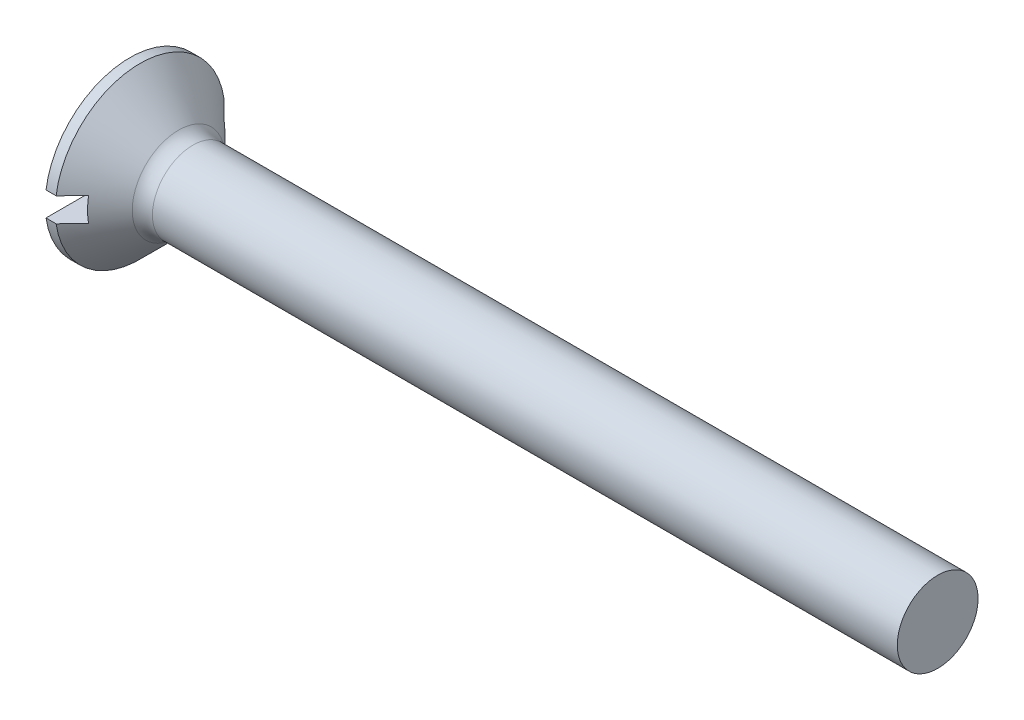
ISO-10303-21;
HEADER;
FILE_DESCRIPTION(('STEP AP214'),'2;1');
FILE_NAME('part.step','',(''),(''),'','','');
FILE_SCHEMA(('AUTOMOTIVE_DESIGN { 1 0 10303 214 1 1 1 1 }'));
ENDSEC;
DATA;
#1=APPLICATION_CONTEXT('core data for automotive mechanical design processes');
#2=APPLICATION_PROTOCOL_DEFINITION('international standard','automotive_design',2000,#1);
#3=PRODUCT_CONTEXT('',#1,'mechanical');
#4=PRODUCT('Part','Part','',(#3));
#5=PRODUCT_RELATED_PRODUCT_CATEGORY('part','',(#4));
#6=PRODUCT_DEFINITION_FORMATION('','',#4);
#7=PRODUCT_DEFINITION_CONTEXT('part definition',#1,'design');
#8=PRODUCT_DEFINITION('design','',#6,#7);
#9=PRODUCT_DEFINITION_SHAPE('','',#8);
#10=(LENGTH_UNIT() NAMED_UNIT(*) SI_UNIT(.MILLI.,.METRE.));
#11=(NAMED_UNIT(*) PLANE_ANGLE_UNIT() SI_UNIT($,.RADIAN.));
#12=(NAMED_UNIT(*) SI_UNIT($,.STERADIAN.) SOLID_ANGLE_UNIT());
#13=UNCERTAINTY_MEASURE_WITH_UNIT(LENGTH_MEASURE(1.E-05),#10,'distance_accuracy_value','');
#14=(GEOMETRIC_REPRESENTATION_CONTEXT(3) GLOBAL_UNCERTAINTY_ASSIGNED_CONTEXT((#13)) GLOBAL_UNIT_ASSIGNED_CONTEXT((#10,
#11,#12)) REPRESENTATION_CONTEXT('',''));
#15=CARTESIAN_POINT('',(0.,0.,0.));
#16=DIRECTION('',(0.,0.,1.));
#17=DIRECTION('',(1.,0.,0.));
#18=AXIS2_PLACEMENT_3D('',#15,#16,#17);
#19=CARTESIAN_POINT('',(0.,0.,0.));
#20=DIRECTION('',(-1.,0.,0.));
#21=DIRECTION('',(0.,0.,1.));
#22=AXIS2_PLACEMENT_3D('',#19,#20,#21);
#23=PLANE('',#22);
#24=DIRECTION('',(0.,0.,-1.));
#25=VECTOR('',#24,1.);
#26=CARTESIAN_POINT('',(0.,0.600000000000001,4.2));
#27=LINE('',#26,#25);
#28=CARTESIAN_POINT('',(0.,0.600000000000001,4.15692193816531));
#29=VERTEX_POINT('',#28);
#30=CARTESIAN_POINT('',(0.,0.6,-4.15692193816531));
#31=VERTEX_POINT('',#30);
#32=EDGE_CURVE('E173',#29,#31,#27,.T.);
#33=ORIENTED_EDGE('',*,*,#32,.F.);
#34=CARTESIAN_POINT('',(0.,0.,0.));
#35=DIRECTION('',(-1.,0.,0.));
#36=DIRECTION('',(0.,0.,1.));
#37=AXIS2_PLACEMENT_3D('',#34,#35,#36);
#38=CIRCLE('',#37,4.2);
#39=EDGE_CURVE('E116',#29,#31,#38,.T.);
#40=ORIENTED_EDGE('',*,*,#39,.T.);
#41=EDGE_LOOP('',(#33,#40));
#42=FACE_BOUND('',#41,.T.);
#43=ADVANCED_FACE('F34',(#42),#23,.T.);
#44=CARTESIAN_POINT('',(-6.34999999999999,0.,0.));
#45=DIRECTION('',(-1.,0.,0.));
#46=DIRECTION('',(0.,0.,1.));
#47=AXIS2_PLACEMENT_3D('',#44,#45,#46);
#48=CYLINDRICAL_SURFACE('',#47,4.2);
#49=DIRECTION('',(-1.,0.,0.));
#50=VECTOR('',#49,1.);
#51=CARTESIAN_POINT('',(-6.34999999999999,0.6,-4.15692193816531));
#52=LINE('',#51,#50);
#53=CARTESIAN_POINT('',(0.500000000000007,0.6,-4.15692193816531));
#54=VERTEX_POINT('',#53);
#55=EDGE_CURVE('E63',#31,#54,#52,.F.);
#56=ORIENTED_EDGE('',*,*,#55,.F.);
#57=ORIENTED_EDGE('',*,*,#39,.F.);
#58=DIRECTION('',(-1.,0.,0.));
#59=VECTOR('',#58,1.);
#60=CARTESIAN_POINT('',(-6.34999999999999,0.600000000000001,4.15692193816531));
#61=LINE('',#60,#59);
#62=CARTESIAN_POINT('',(0.500000000000006,0.600000000000001,4.15692193816531));
#63=VERTEX_POINT('',#62);
#64=EDGE_CURVE('E179',#63,#29,#61,.T.);
#65=ORIENTED_EDGE('',*,*,#64,.F.);
#66=CARTESIAN_POINT('',(0.500000000000007,0.,0.));
#67=DIRECTION('',(-1.,0.,0.));
#68=DIRECTION('',(0.,0.,1.));
#69=AXIS2_PLACEMENT_3D('',#66,#67,#68);
#70=CIRCLE('',#69,4.2);
#71=EDGE_CURVE('E110',#63,#54,#70,.T.);
#72=ORIENTED_EDGE('',*,*,#71,.T.);
#73=EDGE_LOOP('',(#56,#57,#65,#72));
#74=FACE_BOUND('',#73,.T.);
#75=ADVANCED_FACE('F157',(#74),#48,.T.);
#76=DIRECTION('',(0.,0.,1.));
#77=VECTOR('',#76,1.);
#78=CARTESIAN_POINT('',(0.,-0.6,-4.2));
#79=LINE('',#78,#77);
#80=CARTESIAN_POINT('',(0.,-0.6,-4.15692193816531));
#81=VERTEX_POINT('',#80);
#82=CARTESIAN_POINT('',(0.,-0.6,4.15692193816531));
#83=VERTEX_POINT('',#82);
#84=EDGE_CURVE('E104',#81,#83,#79,.T.);
#85=ORIENTED_EDGE('',*,*,#84,.F.);
#86=EDGE_CURVE('E112',#81,#83,#38,.T.);
#87=ORIENTED_EDGE('',*,*,#86,.T.);
#88=EDGE_LOOP('',(#85,#87));
#89=FACE_BOUND('',#88,.T.);
#90=ADVANCED_FACE('F159',(#89),#23,.T.);
#91=DIRECTION('',(-1.,0.,0.));
#92=VECTOR('',#91,1.);
#93=CARTESIAN_POINT('',(-6.34999999999999,-0.6,4.15692193816531));
#94=LINE('',#93,#92);
#95=CARTESIAN_POINT('',(0.500000000000007,-0.6,4.15692193816531));
#96=VERTEX_POINT('',#95);
#97=EDGE_CURVE('E178',#83,#96,#94,.F.);
#98=ORIENTED_EDGE('',*,*,#97,.F.);
#99=ORIENTED_EDGE('',*,*,#86,.F.);
#100=DIRECTION('',(-1.,0.,0.));
#101=VECTOR('',#100,1.);
#102=CARTESIAN_POINT('',(-6.34999999999999,-0.6,-4.15692193816531));
#103=LINE('',#102,#101);
#104=CARTESIAN_POINT('',(0.500000000000006,-0.6,-4.15692193816531));
#105=VERTEX_POINT('',#104);
#106=EDGE_CURVE('E176',#105,#81,#103,.T.);
#107=ORIENTED_EDGE('',*,*,#106,.F.);
#108=EDGE_CURVE('E113',#105,#96,#70,.T.);
#109=ORIENTED_EDGE('',*,*,#108,.T.);
#110=EDGE_LOOP('',(#98,#99,#107,#109));
#111=FACE_BOUND('',#110,.T.);
#112=ADVANCED_FACE('F154',(#111),#48,.T.);
#113=CARTESIAN_POINT('',(0.500000000000007,0.,0.));
#114=DIRECTION('',(-1.,0.,0.));
#115=DIRECTION('',(0.,0.,1.));
#116=AXIS2_PLACEMENT_3D('',#113,#114,#115);
#117=CONICAL_SURFACE('',#116,4.2,0.78539816339745);
#118=CARTESIAN_POINT('',(-4.56300554633495,0.599999999999999,-9.24355298310301));
#119=CARTESIAN_POINT('',(-4.24600723603534,0.599999999999999,-8.9258823515088));
#120=CARTESIAN_POINT('',(-3.92903833767224,0.599999999999999,-8.60818235148397));
#121=CARTESIAN_POINT('',(-3.29519089252671,0.599999999999999,-7.97268003561218));
#122=CARTESIAN_POINT('',(-2.9783123476013,0.599999999999999,-7.65487771791311));
#123=CARTESIAN_POINT('',(-2.34455187800564,0.599999999999999,-7.01900148987752));
#124=CARTESIAN_POINT('',(-2.02767001153055,0.599999999999999,-6.7009275215294));
#125=CARTESIAN_POINT('',(-1.39411705313904,0.599999999999999,-6.06458161569543));
#126=CARTESIAN_POINT('',(-1.07744595737821,0.599999999999999,-5.74630968203734));
#127=CARTESIAN_POINT('',(-0.439782710122295,0.599999999999999,-5.10476781743288));
#128=CARTESIAN_POINT('',(-0.118795367868491,0.6,-4.78149310334206));
#129=CARTESIAN_POINT('',(0.36223794712171,0.6,-4.29611852252878));
#130=CARTESIAN_POINT('',(0.522512438448345,0.6,-4.13424518132526));
#131=CARTESIAN_POINT('',(0.842841859731247,0.6,-3.81028322215852));
#132=CARTESIAN_POINT('',(1.0028967909594,0.6,-3.64819460545316));
#133=CARTESIAN_POINT('',(1.32264436811794,0.6,-3.32374686654892));
#134=CARTESIAN_POINT('',(1.482337100587,0.6,-3.16138782970925));
#135=CARTESIAN_POINT('',(1.80122734793049,0.6,-2.83617699742846));
#136=CARTESIAN_POINT('',(1.96042485168806,0.6,-2.67332519108526));
#137=CARTESIAN_POINT('',(2.27798310090218,0.6,-2.346837401424));
#138=CARTESIAN_POINT('',(2.43634393039256,0.6,-2.1832015001327));
#139=CARTESIAN_POINT('',(2.67269924336134,0.6,-1.93661567733266));
#140=CARTESIAN_POINT('',(2.75128528365289,0.6,-1.85423323958459));
#141=CARTESIAN_POINT('',(2.90787263193202,0.6,-1.68891500745495));
#142=CARTESIAN_POINT('',(2.98587394762441,0.6,-1.60597922039208));
#143=CARTESIAN_POINT('',(3.10544684138226,0.6,-1.47745401397705));
#144=CARTESIAN_POINT('',(3.14733724784236,0.6,-1.43216144834644));
#145=CARTESIAN_POINT('',(3.23076972006657,0.6,-1.34125476648714));
#146=CARTESIAN_POINT('',(3.27231177917342,0.6,-1.29564064414372));
#147=CARTESIAN_POINT('',(3.35490511324607,0.6,-1.20402456521516));
#148=CARTESIAN_POINT('',(3.39595670135904,0.6,-1.15802289202377));
#149=CARTESIAN_POINT('',(3.47741398126422,0.6,-1.06545539858625));
#150=CARTESIAN_POINT('',(3.51781969732899,0.6,-1.01888959965672));
#151=CARTESIAN_POINT('',(3.61534617885595,0.6,-0.904304101505884));
#152=CARTESIAN_POINT('',(3.67198890051813,0.6,-0.835870311358795));
#153=CARTESIAN_POINT('',(3.75443491954113,0.6,-0.731128116472688));
#154=CARTESIAN_POINT('',(3.78151872315025,0.6,-0.695835241457916));
#155=CARTESIAN_POINT('',(3.83442818781308,0.6,-0.624333469704639));
#156=CARTESIAN_POINT('',(3.86025411081286,0.6,-0.58812476608869));
#157=CARTESIAN_POINT('',(3.91931375630114,0.6,-0.50087166671993));
#158=CARTESIAN_POINT('',(3.95177061612795,0.6,-0.449276850099301));
#159=CARTESIAN_POINT('',(3.99577967360525,0.6,-0.369336690861508));
#160=CARTESIAN_POINT('',(4.00966067743336,0.6,-0.342288140870185));
#161=CARTESIAN_POINT('',(4.03525638339725,0.6,-0.287195591030007));
#162=CARTESIAN_POINT('',(4.04697271406413,0.6,-0.259152358592044));
#163=CARTESIAN_POINT('',(4.06984222692527,0.6,-0.195380760375152));
#164=CARTESIAN_POINT('',(4.08024433174417,0.6,-0.159369843717824));
#165=CARTESIAN_POINT('',(4.09489065039257,0.6,-0.0861793611594754));
#166=CARTESIAN_POINT('',(4.09915715820778,0.6,-0.0490045302917274));
#167=CARTESIAN_POINT('',(4.10061628758592,0.6,0.0256851394983992));
#168=CARTESIAN_POINT('',(4.09777267133953,0.6,0.0632007452673669));
#169=CARTESIAN_POINT('',(4.08560858363435,0.6,0.137201967278453));
#170=CARTESIAN_POINT('',(4.0762699402289,0.6,0.173684394091389));
#171=CARTESIAN_POINT('',(4.05240105619193,0.6,0.246171642438104));
#172=CARTESIAN_POINT('',(4.03770931771714,0.6,0.282120755866795));
#173=CARTESIAN_POINT('',(4.0048507034635,0.6,0.352421052836944));
#174=CARTESIAN_POINT('',(3.98667753444948,0.6,0.386769200401987));
#175=CARTESIAN_POINT('',(3.94786976325244,0.6,0.454391698020889));
#176=CARTESIAN_POINT('',(3.92721638813711,0.6,0.487655075912775));
#177=CARTESIAN_POINT('',(3.88433578239059,0.6,0.553097784406296));
#178=CARTESIAN_POINT('',(3.86210991115064,0.6,0.585278016688102));
#179=CARTESIAN_POINT('',(3.81457382028797,0.6,0.651581987389193));
#180=CARTESIAN_POINT('',(3.7891630851111,0.6,0.685633148831193));
#181=CARTESIAN_POINT('',(3.73740972159131,0.6,0.753022281860291));
#182=CARTESIAN_POINT('',(3.71106696643727,0.6,0.786360155399125));
#183=CARTESIAN_POINT('',(3.63101189507472,0.6,0.88559626155308));
#184=CARTESIAN_POINT('',(3.57629754538184,0.6,0.95068359883995));
#185=CARTESIAN_POINT('',(3.46525380311496,0.6,1.07965626888597));
#186=CARTESIAN_POINT('',(3.40892163508868,0.6,1.14353918079178));
#187=CARTESIAN_POINT('',(3.29530585051175,0.6,1.27041803727517));
#188=CARTESIAN_POINT('',(3.23802251714466,0.6,1.33341423588146));
#189=CARTESIAN_POINT('',(3.12298479001919,0.6,1.45862383839196));
#190=CARTESIAN_POINT('',(3.06523233266877,0.6,1.52083902752064));
#191=CARTESIAN_POINT('',(2.94927074499088,0.6,1.64485037779584));
#192=CARTESIAN_POINT('',(2.89106158145176,0.6,1.70664650784765));
#193=CARTESIAN_POINT('',(2.71607782742413,0.6,1.8914362035954));
#194=CARTESIAN_POINT('',(2.598818175117,0.6,2.01396998991091));
#195=CARTESIAN_POINT('',(2.36411448960321,0.6,2.25774708248496));
#196=CARTESIAN_POINT('',(2.2466739355813,0.6,2.37899374959426));
#197=CARTESIAN_POINT('',(2.011320643903,0.6,2.62102822482681));
#198=CARTESIAN_POINT('',(1.89340790524034,0.6,2.74181603197111));
#199=CARTESIAN_POINT('',(1.53920067574072,0.600000000000001,3.10372997116225));
#200=CARTESIAN_POINT('',(1.30244210211621,0.6,3.34440153097691));
#201=CARTESIAN_POINT('',(0.82819572456852,0.6,3.82523070246839));
#202=CARTESIAN_POINT('',(0.590707648083579,0.600000000000001,4.06538804483313));
#203=CARTESIAN_POINT('',(0.115359689803594,0.600000000000001,4.54532999337504));
#204=CARTESIAN_POINT('',(-0.122500188487137,0.600000000000001,4.78511460302332));
#205=CARTESIAN_POINT('',(-0.598435859528589,0.600000000000001,5.26442998810648));
#206=CARTESIAN_POINT('',(-0.836511632808679,0.600000000000001,5.50396078288318));
#207=CARTESIAN_POINT('',(-1.31282357210654,0.600000000000001,5.9828640036053));
#208=CARTESIAN_POINT('',(-1.55105973851771,0.600000000000001,6.22223642915941));
#209=CARTESIAN_POINT('',(-2.26588146323332,0.600000000000001,6.94013600092059));
#210=CARTESIAN_POINT('',(-2.74263267398125,0.600000000000001,7.41849819223158));
#211=CARTESIAN_POINT('',(-3.33143893672129,0.600000000000001,8.0089998304997));
#212=CARTESIAN_POINT('',(-3.44338145682948,0.600000000000001,8.12125154439743));
#213=CARTESIAN_POINT('',(-3.66728071302648,0.600000000000001,8.34574469921585));
#214=CARTESIAN_POINT('',(-3.77923744932913,0.600000000000001,8.45798613992331));
#215=CARTESIAN_POINT('',(-4.0031582180191,0.600000000000001,8.68245495354624));
#216=CARTESIAN_POINT('',(-4.11512225008233,0.600000000000001,8.79468232678506));
#217=CARTESIAN_POINT('',(-4.33905795383686,0.600000000000001,9.019125541103));
#218=CARTESIAN_POINT('',(-4.45102962536065,0.600000000000001,9.13134138234926));
#219=CARTESIAN_POINT('',(-4.56300554633495,0.600000000000001,9.24355298310301));
#220=B_SPLINE_CURVE_WITH_KNOTS('',3,(#118,#119,#120,#121,#122,#123,#124,#125,#126,#127,#128,
#129,#130,#131,#132,#133,#134,#135,#136,#137,#138,#139,#140,#141,#142,#143,#144,#145,#146,#147,
#148,#149,#150,#151,#152,#153,#154,#155,#156,#157,#158,#159,#160,#161,#162,#163,#164,#165,#166,
#167,#168,#169,#170,#171,#172,#173,#174,#175,#176,#177,#178,#179,#180,#181,#182,#183,#184,#185,
#186,#187,#188,#189,#190,#191,#192,#193,#194,#195,#196,#197,#198,#199,#200,#201,#202,#203,#204,
#205,#206,#207,#208,#209,#210,#211,#212,#213,#214,#215,#216,#217,#218,#219),.UNSPECIFIED.,.F.,
.F.,(4,2,2,2,2,2,2,2,2,2,2,2,2,2,2,2,2,2,2,2,2,2,2,2,2,2,2,2,2,2,2,2,2,2,2,2,2,2,2,2,2,2,2,2,2,
2,2,2,2,2,4),(0.,1.34633691031338,2.69269974149251,4.0396467751563,5.38656852786772,
6.75326280996177,7.43664982710675,8.1200328686116,8.80323043061791,9.4864432199041,
10.1695860319826,10.5111450988142,10.8526996570424,11.03778202096,11.2228679139641,
11.4078285352327,11.5927821890647,11.8592146640371,11.9926530436262,12.1260635156147,
12.3086320349772,12.399769493737,12.490838106084,12.6028793993505,12.7145125475576,
12.8267158093192,12.939234265636,13.0554743148281,13.1719265035455,13.2893234418316,
13.4066201044699,13.5340600053015,13.6615173128626,13.91655652205,14.1720630220887,
14.4274947695286,14.6821578166047,14.9368395576516,15.4456347637855,15.9520298164414,
16.4584259488448,17.4712394731476,18.484493856319,19.4977387462517,20.5108998896107,
21.5240635270661,23.5501676869924,24.0257559307744,24.5013524664906,24.9769345830622,
25.4525083962336),.UNSPECIFIED.);
#221=CARTESIAN_POINT('',(1.3,0.600000000000001,3.34664010613631));
#222=VERTEX_POINT('',#221);
#223=EDGE_CURVE('E11',#222,#63,#220,.T.);
#224=ORIENTED_EDGE('',*,*,#223,.F.);
#225=CARTESIAN_POINT('',(1.3,0.,0.));
#226=DIRECTION('',(1.,0.,0.));
#227=DIRECTION('',(0.,0.,-1.));
#228=AXIS2_PLACEMENT_3D('',#225,#226,#227);
#229=CIRCLE('',#228,3.40000000000001);
#230=CARTESIAN_POINT('',(1.3,-0.6,3.34664010613631));
#231=VERTEX_POINT('',#230);
#232=EDGE_CURVE('E92',#231,#222,#229,.F.);
#233=ORIENTED_EDGE('',*,*,#232,.F.);
#234=CARTESIAN_POINT('',(-4.56300554633495,-0.6,9.24355298310301));
#235=CARTESIAN_POINT('',(-4.24600723603534,-0.6,8.9258823515088));
#236=CARTESIAN_POINT('',(-3.92903833767224,-0.6,8.60818235148398));
#237=CARTESIAN_POINT('',(-3.29519089252672,-0.6,7.97268003561219));
#238=CARTESIAN_POINT('',(-2.97831234760131,-0.6,7.65487771791312));
#239=CARTESIAN_POINT('',(-2.34455187800564,-0.6,7.01900148987753));
#240=CARTESIAN_POINT('',(-2.02767001153055,-0.6,6.70092752152941));
#241=CARTESIAN_POINT('',(-1.39411705313905,-0.6,6.06458161569544));
#242=CARTESIAN_POINT('',(-1.07744595737822,-0.6,5.74630968203735));
#243=CARTESIAN_POINT('',(-0.439782710122304,-0.6,5.10476781743289));
#244=CARTESIAN_POINT('',(-0.118795367868499,-0.6,4.78149310334206));
#245=CARTESIAN_POINT('',(0.362237947121704,-0.6,4.29611852252879));
#246=CARTESIAN_POINT('',(0.522512438448339,-0.6,4.13424518132527));
#247=CARTESIAN_POINT('',(0.842841859731241,-0.6,3.81028322215852));
#248=CARTESIAN_POINT('',(1.00289679095939,-0.6,3.64819460545317));
#249=CARTESIAN_POINT('',(1.32264436811793,-0.6,3.32374686654893));
#250=CARTESIAN_POINT('',(1.482337100587,-0.6,3.16138782970926));
#251=CARTESIAN_POINT('',(1.80122734793049,-0.6,2.83617699742846));
#252=CARTESIAN_POINT('',(1.96042485168806,-0.6,2.67332519108526));
#253=CARTESIAN_POINT('',(2.27798310090218,-0.6,2.346837401424));
#254=CARTESIAN_POINT('',(2.43634393039256,-0.6,2.1832015001327));
#255=CARTESIAN_POINT('',(2.67269924336134,-0.6,1.93661567733266));
#256=CARTESIAN_POINT('',(2.75128528365289,-0.6,1.85423323958459));
#257=CARTESIAN_POINT('',(2.90787263193202,-0.6,1.68891500745495));
#258=CARTESIAN_POINT('',(2.98587394762441,-0.6,1.60597922039208));
#259=CARTESIAN_POINT('',(3.10544684138226,-0.6,1.47745401397705));
#260=CARTESIAN_POINT('',(3.14733724784236,-0.6,1.43216144834644));
#261=CARTESIAN_POINT('',(3.23076972006657,-0.6,1.34125476648714));
#262=CARTESIAN_POINT('',(3.27231177917342,-0.6,1.29564064414372));
#263=CARTESIAN_POINT('',(3.35490511324607,-0.6,1.20402456521516));
#264=CARTESIAN_POINT('',(3.39595670135904,-0.6,1.15802289202377));
#265=CARTESIAN_POINT('',(3.47741398126422,-0.6,1.06545539858625));
#266=CARTESIAN_POINT('',(3.51781969732899,-0.6,1.01888959965672));
#267=CARTESIAN_POINT('',(3.61534617885595,-0.6,0.904304101505885));
#268=CARTESIAN_POINT('',(3.67198890051813,-0.6,0.835870311358795));
#269=CARTESIAN_POINT('',(3.75443491954113,-0.6,0.731128116472689));
#270=CARTESIAN_POINT('',(3.78151872315026,-0.6,0.695835241457916));
#271=CARTESIAN_POINT('',(3.83442818781308,-0.6,0.624333469704639));
#272=CARTESIAN_POINT('',(3.86025411081286,-0.6,0.58812476608869));
#273=CARTESIAN_POINT('',(3.91931375630114,-0.6,0.50087166671993));
#274=CARTESIAN_POINT('',(3.95177061612795,-0.6,0.449276850099301));
#275=CARTESIAN_POINT('',(3.99577967360525,-0.6,0.369336690861508));
#276=CARTESIAN_POINT('',(4.00966067743336,-0.6,0.342288140870184));
#277=CARTESIAN_POINT('',(4.03525638339725,-0.6,0.287195591030006));
#278=CARTESIAN_POINT('',(4.04697271406413,-0.6,0.259152358592043));
#279=CARTESIAN_POINT('',(4.06984222692527,-0.6,0.195380760375152));
#280=CARTESIAN_POINT('',(4.08024433174417,-0.6,0.159369843717824));
#281=CARTESIAN_POINT('',(4.09489065039257,-0.6,0.0861793611594756));
#282=CARTESIAN_POINT('',(4.09915715820778,-0.6,0.0490045302917269));
#283=CARTESIAN_POINT('',(4.10061628758592,-0.6,-0.0256851394984001));
#284=CARTESIAN_POINT('',(4.09777267133953,-0.6,-0.0632007452673677));
#285=CARTESIAN_POINT('',(4.08560858363435,-0.6,-0.137201967278454));
#286=CARTESIAN_POINT('',(4.0762699402289,-0.6,-0.17368439409139));
#287=CARTESIAN_POINT('',(4.05240105619193,-0.6,-0.246171642438105));
#288=CARTESIAN_POINT('',(4.03770931771714,-0.6,-0.282120755866796));
#289=CARTESIAN_POINT('',(4.0048507034635,-0.6,-0.352421052836944));
#290=CARTESIAN_POINT('',(3.98667753444948,-0.6,-0.386769200401988));
#291=CARTESIAN_POINT('',(3.94786976325244,-0.6,-0.454391698020891));
#292=CARTESIAN_POINT('',(3.92721638813711,-0.6,-0.487655075912776));
#293=CARTESIAN_POINT('',(3.88433578239058,-0.6,-0.553097784406298));
#294=CARTESIAN_POINT('',(3.86210991115064,-0.6,-0.585278016688103));
#295=CARTESIAN_POINT('',(3.81457382028797,-0.6,-0.651581987389195));
#296=CARTESIAN_POINT('',(3.7891630851111,-0.6,-0.685633148831196));
#297=CARTESIAN_POINT('',(3.73740972159131,-0.6,-0.753022281860294));
#298=CARTESIAN_POINT('',(3.71106696643727,-0.6,-0.786360155399128));
#299=CARTESIAN_POINT('',(3.63101189507472,-0.6,-0.885596261553083));
#300=CARTESIAN_POINT('',(3.57629754538183,-0.6,-0.950683598839953));
#301=CARTESIAN_POINT('',(3.46525380311496,-0.6,-1.07965626888597));
#302=CARTESIAN_POINT('',(3.40892163508867,-0.6,-1.14353918079179));
#303=CARTESIAN_POINT('',(3.29530585051174,-0.6,-1.27041803727518));
#304=CARTESIAN_POINT('',(3.23802251714465,-0.6,-1.33341423588146));
#305=CARTESIAN_POINT('',(3.12298479001918,-0.6,-1.45862383839197));
#306=CARTESIAN_POINT('',(3.06523233266876,-0.6,-1.52083902752064));
#307=CARTESIAN_POINT('',(2.94927074499087,-0.6,-1.64485037779584));
#308=CARTESIAN_POINT('',(2.89106158145175,-0.6,-1.70664650784766));
#309=CARTESIAN_POINT('',(2.71607782742412,-0.6,-1.89143620359541));
#310=CARTESIAN_POINT('',(2.59881817511699,-0.6,-2.01396998991092));
#311=CARTESIAN_POINT('',(2.36411448960321,-0.6,-2.25774708248497));
#312=CARTESIAN_POINT('',(2.24667393558129,-0.6,-2.37899374959427));
#313=CARTESIAN_POINT('',(2.01132064390299,-0.6,-2.62102822482682));
#314=CARTESIAN_POINT('',(1.89340790524033,-0.6,-2.74181603197112));
#315=CARTESIAN_POINT('',(1.53920067574071,-0.6,-3.10372997116226));
#316=CARTESIAN_POINT('',(1.3024421021162,-0.6,-3.34440153097693));
#317=CARTESIAN_POINT('',(0.828195724568509,-0.6,-3.8252307024684));
#318=CARTESIAN_POINT('',(0.590707648083567,-0.6,-4.06538804483314));
#319=CARTESIAN_POINT('',(0.11535968980358,-0.6,-4.54532999337506));
#320=CARTESIAN_POINT('',(-0.122500188487153,-0.6,-4.78511460302334));
#321=CARTESIAN_POINT('',(-0.598435859528608,-0.6,-5.2644299881065));
#322=CARTESIAN_POINT('',(-0.8365116328087,-0.6,-5.5039607828832));
#323=CARTESIAN_POINT('',(-1.31282357210657,-0.6,-5.98286400360532));
#324=CARTESIAN_POINT('',(-1.55105973851774,-0.6,-6.22223642915943));
#325=CARTESIAN_POINT('',(-2.26588146323335,-0.6,-6.94013600092061));
#326=CARTESIAN_POINT('',(-2.74263267398128,-0.6,-7.41849819223161));
#327=CARTESIAN_POINT('',(-3.33143893672131,-0.6,-8.00899983049973));
#328=CARTESIAN_POINT('',(-3.4433814568295,-0.6,-8.12125154439746));
#329=CARTESIAN_POINT('',(-3.6672807130265,-0.6,-8.34574469921587));
#330=CARTESIAN_POINT('',(-3.77923744932914,-0.6,-8.45798613992333));
#331=CARTESIAN_POINT('',(-4.00315821801911,-0.6,-8.68245495354626));
#332=CARTESIAN_POINT('',(-4.11512225008233,-0.6,-8.79468232678506));
#333=CARTESIAN_POINT('',(-4.33905795383686,-0.6,-9.019125541103));
#334=CARTESIAN_POINT('',(-4.45102962536065,-0.6,-9.13134138234926));
#335=CARTESIAN_POINT('',(-4.56300554633495,-0.6,-9.24355298310301));
#336=B_SPLINE_CURVE_WITH_KNOTS('',3,(#234,#235,#236,#237,#238,#239,#240,#241,#242,#243,#244,
#245,#246,#247,#248,#249,#250,#251,#252,#253,#254,#255,#256,#257,#258,#259,#260,#261,#262,#263,
#264,#265,#266,#267,#268,#269,#270,#271,#272,#273,#274,#275,#276,#277,#278,#279,#280,#281,#282,
#283,#284,#285,#286,#287,#288,#289,#290,#291,#292,#293,#294,#295,#296,#297,#298,#299,#300,#301,
#302,#303,#304,#305,#306,#307,#308,#309,#310,#311,#312,#313,#314,#315,#316,#317,#318,#319,#320,
#321,#322,#323,#324,#325,#326,#327,#328,#329,#330,#331,#332,#333,#334,#335),.UNSPECIFIED.,.F.,
.F.,(4,2,2,2,2,2,2,2,2,2,2,2,2,2,2,2,2,2,2,2,2,2,2,2,2,2,2,2,2,2,2,2,2,2,2,2,2,2,2,2,2,2,2,2,2,
2,2,2,2,2,4),(0.,1.34633691031337,2.6926997414925,4.03964677515629,5.3865685278677,
6.75326280996176,7.43664982710674,8.1200328686116,8.8032304306179,9.4864432199041,
10.1695860319826,10.5111450988142,10.8526996570424,11.03778202096,11.2228679139641,
11.4078285352327,11.5927821890647,11.8592146640371,11.9926530436262,12.1260635156147,
12.3086320349772,12.399769493737,12.490838106084,12.6028793993505,12.7145125475576,
12.8267158093192,12.939234265636,13.0554743148281,13.1719265035455,13.2893234418316,
13.4066201044699,13.5340600053015,13.6615173128626,13.9165565220501,14.1720630220887,
14.4274947695287,14.6821578166047,14.9368395576516,15.4456347637855,15.9520298164414,
16.4584259488448,17.4712394731476,18.484493856319,19.4977387462518,20.5108998896108,
21.5240635270661,23.5501676869924,24.0257559307745,24.5013524664906,24.9769345830622,
25.4525083962336),.UNSPECIFIED.);
#337=EDGE_CURVE('E49',#96,#231,#336,.T.);
#338=ORIENTED_EDGE('',*,*,#337,.F.);
#339=ORIENTED_EDGE('',*,*,#108,.F.);
#340=CARTESIAN_POINT('',(1.3,-0.6,-3.34664010613631));
#341=VERTEX_POINT('',#340);
#342=EDGE_CURVE('E128',#341,#105,#336,.T.);
#343=ORIENTED_EDGE('',*,*,#342,.F.);
#344=CARTESIAN_POINT('',(1.3,0.6,-3.34664010613631));
#345=VERTEX_POINT('',#344);
#346=EDGE_CURVE('E100',#345,#341,#229,.F.);
#347=ORIENTED_EDGE('',*,*,#346,.F.);
#348=EDGE_CURVE('E38',#54,#345,#220,.T.);
#349=ORIENTED_EDGE('',*,*,#348,.F.);
#350=ORIENTED_EDGE('',*,*,#71,.F.);
#351=EDGE_LOOP('',(#224,#233,#338,#339,#343,#347,#349,#350));
#352=FACE_BOUND('',#351,.T.);
#353=CARTESIAN_POINT('',(2.40710678118655,0.,0.));
#354=DIRECTION('',(-1.,0.,0.));
#355=DIRECTION('',(0.,0.,1.));
#356=AXIS2_PLACEMENT_3D('',#353,#354,#355);
#357=CIRCLE('',#356,2.29289321881345);
#358=CARTESIAN_POINT('',(2.40710678118655,0.,2.29289321881345));
#359=VERTEX_POINT('',#358);
#360=EDGE_CURVE('E123',#359,#359,#357,.T.);
#361=ORIENTED_EDGE('',*,*,#360,.T.);
#362=EDGE_LOOP('',(#361));
#363=FACE_BOUND('',#362,.T.);
#364=ADVANCED_FACE('F107',(#352,#363),#117,.T.);
#365=CARTESIAN_POINT('',(-6.34999999999999,0.,0.));
#366=DIRECTION('',(-1.,0.,0.));
#367=DIRECTION('',(0.,0.,1.));
#368=AXIS2_PLACEMENT_3D('',#365,#366,#367);
#369=CYLINDRICAL_SURFACE('',#368,2.);
#370=CARTESIAN_POINT('',(3.1142135623731,0.,0.));
#371=DIRECTION('',(-1.,0.,0.));
#372=DIRECTION('',(0.,0.,1.));
#373=AXIS2_PLACEMENT_3D('',#370,#371,#372);
#374=CIRCLE('',#373,2.);
#375=CARTESIAN_POINT('',(3.1142135623731,0.,2.));
#376=VERTEX_POINT('',#375);
#377=EDGE_CURVE('E126',#376,#376,#374,.F.);
#378=ORIENTED_EDGE('',*,*,#377,.T.);
#379=EDGE_LOOP('',(#378));
#380=FACE_BOUND('',#379,.T.);
#381=CARTESIAN_POINT('',(40.,0.,0.));
#382=DIRECTION('',(-1.,0.,0.));
#383=DIRECTION('',(0.,0.,1.));
#384=AXIS2_PLACEMENT_3D('',#381,#382,#383);
#385=CIRCLE('',#384,2.);
#386=CARTESIAN_POINT('',(40.,0.,2.));
#387=VERTEX_POINT('',#386);
#388=EDGE_CURVE('E119',#387,#387,#385,.T.);
#389=ORIENTED_EDGE('',*,*,#388,.T.);
#390=EDGE_LOOP('',(#389));
#391=FACE_BOUND('',#390,.T.);
#392=ADVANCED_FACE('F147',(#380,#391),#369,.T.);
#393=CARTESIAN_POINT('',(40.,2.,0.));
#394=DIRECTION('',(1.,0.,0.));
#395=DIRECTION('',(0.,0.,-1.));
#396=AXIS2_PLACEMENT_3D('',#393,#394,#395);
#397=PLANE('',#396);
#398=ORIENTED_EDGE('',*,*,#388,.F.);
#399=EDGE_LOOP('',(#398));
#400=FACE_BOUND('',#399,.T.);
#401=ADVANCED_FACE('F145',(#400),#397,.T.);
#402=CARTESIAN_POINT('',(3.1142135623731,0.,0.));
#403=DIRECTION('',(-1.,0.,0.));
#404=DIRECTION('',(0.,0.,1.));
#405=AXIS2_PLACEMENT_3D('',#402,#403,#404);
#406=TOROIDAL_SURFACE('',#405,3.,1.);
#407=ORIENTED_EDGE('',*,*,#377,.F.);
#408=EDGE_LOOP('',(#407));
#409=FACE_BOUND('',#408,.T.);
#410=ORIENTED_EDGE('',*,*,#360,.F.);
#411=EDGE_LOOP('',(#410));
#412=FACE_BOUND('',#411,.T.);
#413=ADVANCED_FACE('F36',(#409,#412),#406,.F.);
#414=CARTESIAN_POINT('',(1.3,0.600000000000001,4.2));
#415=DIRECTION('',(0.,1.,0.));
#416=DIRECTION('',(0.,0.,1.));
#417=AXIS2_PLACEMENT_3D('',#414,#415,#416);
#418=PLANE('',#417);
#419=ORIENTED_EDGE('',*,*,#55,.T.);
#420=ORIENTED_EDGE('',*,*,#348,.T.);
#421=DIRECTION('',(0.,0.,-1.));
#422=VECTOR('',#421,1.);
#423=CARTESIAN_POINT('',(1.3,0.600000000000001,4.2));
#424=LINE('',#423,#422);
#425=EDGE_CURVE('E56',#222,#345,#424,.T.);
#426=ORIENTED_EDGE('',*,*,#425,.F.);
#427=ORIENTED_EDGE('',*,*,#223,.T.);
#428=ORIENTED_EDGE('',*,*,#64,.T.);
#429=ORIENTED_EDGE('',*,*,#32,.T.);
#430=EDGE_LOOP('',(#419,#420,#426,#427,#428,#429));
#431=FACE_BOUND('',#430,.T.);
#432=ADVANCED_FACE('F101',(#431),#418,.F.);
#433=CARTESIAN_POINT('',(1.3,-0.6,-4.2));
#434=DIRECTION('',(0.,-1.,0.));
#435=DIRECTION('',(0.,0.,-1.));
#436=AXIS2_PLACEMENT_3D('',#433,#434,#435);
#437=PLANE('',#436);
#438=ORIENTED_EDGE('',*,*,#97,.T.);
#439=ORIENTED_EDGE('',*,*,#337,.T.);
#440=DIRECTION('',(0.,0.,1.));
#441=VECTOR('',#440,1.);
#442=CARTESIAN_POINT('',(1.3,-0.6,-4.2));
#443=LINE('',#442,#441);
#444=EDGE_CURVE('E95',#341,#231,#443,.T.);
#445=ORIENTED_EDGE('',*,*,#444,.F.);
#446=ORIENTED_EDGE('',*,*,#342,.T.);
#447=ORIENTED_EDGE('',*,*,#106,.T.);
#448=ORIENTED_EDGE('',*,*,#84,.T.);
#449=EDGE_LOOP('',(#438,#439,#445,#446,#447,#448));
#450=FACE_BOUND('',#449,.T.);
#451=ADVANCED_FACE('F137',(#450),#437,.F.);
#452=CARTESIAN_POINT('',(1.3,-0.6,-4.2));
#453=DIRECTION('',(1.,0.,0.));
#454=DIRECTION('',(0.,0.,-1.));
#455=AXIS2_PLACEMENT_3D('',#452,#453,#454);
#456=PLANE('',#455);
#457=ORIENTED_EDGE('',*,*,#232,.T.);
#458=ORIENTED_EDGE('',*,*,#425,.T.);
#459=ORIENTED_EDGE('',*,*,#346,.T.);
#460=ORIENTED_EDGE('',*,*,#444,.T.);
#461=EDGE_LOOP('',(#457,#458,#459,#460));
#462=FACE_BOUND('',#461,.T.);
#463=ADVANCED_FACE('F93',(#462),#456,.F.);
#464=CLOSED_SHELL('',(#43,#75,#90,#112,#364,#392,#401,#413,#432,#451,#463));
#465=MANIFOLD_SOLID_BREP('B2',#464);
#466=ADVANCED_BREP_SHAPE_REPRESENTATION('',(#18,#465),#14);
#467=SHAPE_DEFINITION_REPRESENTATION(#9,#466);
ENDSEC;
END-ISO-10303-21;
